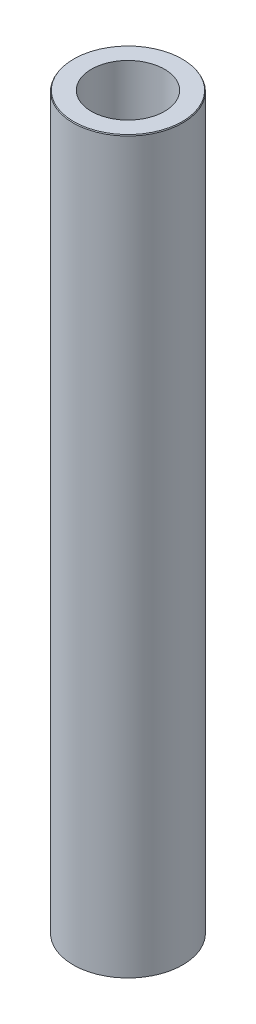
ISO-10303-21;
HEADER;
FILE_DESCRIPTION(('STEP AP214'),'2;1');
FILE_NAME('part.step','',(''),(''),'','','');
FILE_SCHEMA(('AUTOMOTIVE_DESIGN { 1 0 10303 214 1 1 1 1 }'));
ENDSEC;
DATA;
#1=APPLICATION_CONTEXT('core data for automotive mechanical design processes');
#2=APPLICATION_PROTOCOL_DEFINITION('international standard','automotive_design',2000,#1);
#3=PRODUCT_CONTEXT('',#1,'mechanical');
#4=PRODUCT('Part','Part','',(#3));
#5=PRODUCT_RELATED_PRODUCT_CATEGORY('part','',(#4));
#6=PRODUCT_DEFINITION_FORMATION('','',#4);
#7=PRODUCT_DEFINITION_CONTEXT('part definition',#1,'design');
#8=PRODUCT_DEFINITION('design','',#6,#7);
#9=PRODUCT_DEFINITION_SHAPE('','',#8);
#10=(LENGTH_UNIT() NAMED_UNIT(*) SI_UNIT(.MILLI.,.METRE.));
#11=(NAMED_UNIT(*) PLANE_ANGLE_UNIT() SI_UNIT($,.RADIAN.));
#12=(NAMED_UNIT(*) SI_UNIT($,.STERADIAN.) SOLID_ANGLE_UNIT());
#13=UNCERTAINTY_MEASURE_WITH_UNIT(LENGTH_MEASURE(1.E-05),#10,'distance_accuracy_value','');
#14=(GEOMETRIC_REPRESENTATION_CONTEXT(3) GLOBAL_UNCERTAINTY_ASSIGNED_CONTEXT((#13)) GLOBAL_UNIT_ASSIGNED_CONTEXT((#10,
#11,#12)) REPRESENTATION_CONTEXT('',''));
#15=CARTESIAN_POINT('',(0.,0.,0.));
#16=DIRECTION('',(0.,0.,1.));
#17=DIRECTION('',(1.,0.,0.));
#18=AXIS2_PLACEMENT_3D('',#15,#16,#17);
#19=CARTESIAN_POINT('',(0.,600.,0.));
#20=DIRECTION('',(0.,-1.,0.));
#21=DIRECTION('',(0.,0.,-1.));
#22=AXIS2_PLACEMENT_3D('',#19,#20,#21);
#23=CYLINDRICAL_SURFACE('',#22,45.);
#24=CARTESIAN_POINT('',(0.,599.258354239562,0.));
#25=DIRECTION('',(0.,1.,0.));
#26=DIRECTION('',(0.,0.,1.));
#27=AXIS2_PLACEMENT_3D('',#24,#25,#26);
#28=CIRCLE('',#27,45.);
#29=CARTESIAN_POINT('',(0.,599.258354239562,45.));
#30=VERTEX_POINT('',#29);
#31=EDGE_CURVE('E50',#30,#30,#28,.F.);
#32=ORIENTED_EDGE('',*,*,#31,.T.);
#33=EDGE_LOOP('',(#32));
#34=FACE_BOUND('',#33,.T.);
#35=CARTESIAN_POINT('',(0.,0.458826719989869,0.));
#36=DIRECTION('',(0.,1.,0.));
#37=DIRECTION('',(0.,0.,1.));
#38=AXIS2_PLACEMENT_3D('',#35,#36,#37);
#39=CIRCLE('',#38,45.);
#40=CARTESIAN_POINT('',(0.,0.458826719989869,45.));
#41=VERTEX_POINT('',#40);
#42=EDGE_CURVE('E51',#41,#41,#39,.T.);
#43=ORIENTED_EDGE('',*,*,#42,.T.);
#44=EDGE_LOOP('',(#43));
#45=FACE_BOUND('',#44,.T.);
#46=ADVANCED_FACE('F39',(#34,#45),#23,.T.);
#47=CARTESIAN_POINT('',(0.,600.,0.));
#48=DIRECTION('',(0.,1.,0.));
#49=DIRECTION('',(0.,0.,1.));
#50=AXIS2_PLACEMENT_3D('',#47,#48,#49);
#51=PLANE('',#50);
#52=CARTESIAN_POINT('',(0.,600.,0.));
#53=DIRECTION('',(0.,1.,0.));
#54=DIRECTION('',(0.,0.,1.));
#55=AXIS2_PLACEMENT_3D('',#52,#53,#54);
#56=CIRCLE('',#55,44.5411732800102);
#57=CARTESIAN_POINT('',(0.,600.,44.5411732800102));
#58=VERTEX_POINT('',#57);
#59=EDGE_CURVE('E54',#58,#58,#56,.T.);
#60=ORIENTED_EDGE('',*,*,#59,.T.);
#61=EDGE_LOOP('',(#60));
#62=FACE_BOUND('',#61,.T.);
#63=CARTESIAN_POINT('',(0.,600.,0.));
#64=DIRECTION('',(0.,1.,0.));
#65=DIRECTION('',(0.,0.,1.));
#66=AXIS2_PLACEMENT_3D('',#63,#64,#65);
#67=CIRCLE('',#66,30.027428976669);
#68=CARTESIAN_POINT('',(0.,600.,30.027428976669));
#69=VERTEX_POINT('',#68);
#70=EDGE_CURVE('E58',#69,#69,#67,.T.);
#71=ORIENTED_EDGE('',*,*,#70,.F.);
#72=EDGE_LOOP('',(#71));
#73=FACE_BOUND('',#72,.T.);
#74=ADVANCED_FACE('F69',(#62,#73),#51,.T.);
#75=CARTESIAN_POINT('',(0.,0.,0.));
#76=DIRECTION('',(0.,1.,0.));
#77=DIRECTION('',(0.,0.,1.));
#78=AXIS2_PLACEMENT_3D('',#75,#76,#77);
#79=PLANE('',#78);
#80=CARTESIAN_POINT('',(0.,0.,0.));
#81=DIRECTION('',(0.,1.,0.));
#82=DIRECTION('',(0.,0.,1.));
#83=AXIS2_PLACEMENT_3D('',#80,#81,#82);
#84=CIRCLE('',#83,44.2583542395618);
#85=CARTESIAN_POINT('',(0.,0.,44.2583542395618));
#86=VERTEX_POINT('',#85);
#87=EDGE_CURVE('E10',#86,#86,#84,.F.);
#88=ORIENTED_EDGE('',*,*,#87,.T.);
#89=EDGE_LOOP('',(#88));
#90=FACE_BOUND('',#89,.T.);
#91=CARTESIAN_POINT('',(0.,0.,0.));
#92=DIRECTION('',(0.,1.,0.));
#93=DIRECTION('',(0.,0.,1.));
#94=AXIS2_PLACEMENT_3D('',#91,#92,#93);
#95=CIRCLE('',#94,30.027428976669);
#96=CARTESIAN_POINT('',(0.,0.,30.027428976669));
#97=VERTEX_POINT('',#96);
#98=EDGE_CURVE('E63',#97,#97,#95,.T.);
#99=ORIENTED_EDGE('',*,*,#98,.T.);
#100=EDGE_LOOP('',(#99));
#101=FACE_BOUND('',#100,.T.);
#102=ADVANCED_FACE('F75',(#90,#101),#79,.F.);
#103=CARTESIAN_POINT('',(0.,600.,0.));
#104=DIRECTION('',(0.,-1.,0.));
#105=DIRECTION('',(0.,0.,-1.));
#106=AXIS2_PLACEMENT_3D('',#103,#104,#105);
#107=CYLINDRICAL_SURFACE('',#106,30.027428976669);
#108=ORIENTED_EDGE('',*,*,#70,.T.);
#109=EDGE_LOOP('',(#108));
#110=FACE_BOUND('',#109,.T.);
#111=ORIENTED_EDGE('',*,*,#98,.F.);
#112=EDGE_LOOP('',(#111));
#113=FACE_BOUND('',#112,.T.);
#114=ADVANCED_FACE('F70',(#110,#113),#107,.F.);
#115=CARTESIAN_POINT('',(0.,600.,0.));
#116=DIRECTION('',(0.,-1.,0.));
#117=DIRECTION('',(0.,0.,-1.));
#118=AXIS2_PLACEMENT_3D('',#115,#116,#117);
#119=CONICAL_SURFACE('',#118,44.5411732800102,0.554027368090639);
#120=ORIENTED_EDGE('',*,*,#31,.F.);
#121=EDGE_LOOP('',(#120));
#122=FACE_BOUND('',#121,.T.);
#123=ORIENTED_EDGE('',*,*,#59,.F.);
#124=EDGE_LOOP('',(#123));
#125=FACE_BOUND('',#124,.T.);
#126=ADVANCED_FACE('F81',(#122,#125),#119,.T.);
#127=CARTESIAN_POINT('',(0.,0.458826719989869,0.));
#128=DIRECTION('',(0.,1.,0.));
#129=DIRECTION('',(0.,0.,1.));
#130=AXIS2_PLACEMENT_3D('',#127,#128,#129);
#131=CONICAL_SURFACE('',#130,45.,1.0167689587042);
#132=ORIENTED_EDGE('',*,*,#87,.F.);
#133=EDGE_LOOP('',(#132));
#134=FACE_BOUND('',#133,.T.);
#135=ORIENTED_EDGE('',*,*,#42,.F.);
#136=EDGE_LOOP('',(#135));
#137=FACE_BOUND('',#136,.T.);
#138=ADVANCED_FACE('F45',(#134,#137),#131,.T.);
#139=CLOSED_SHELL('',(#46,#74,#102,#114,#126,#138));
#140=MANIFOLD_SOLID_BREP('B2',#139);
#141=ADVANCED_BREP_SHAPE_REPRESENTATION('',(#18,#140),#14);
#142=SHAPE_DEFINITION_REPRESENTATION(#9,#141);
ENDSEC;
END-ISO-10303-21;
